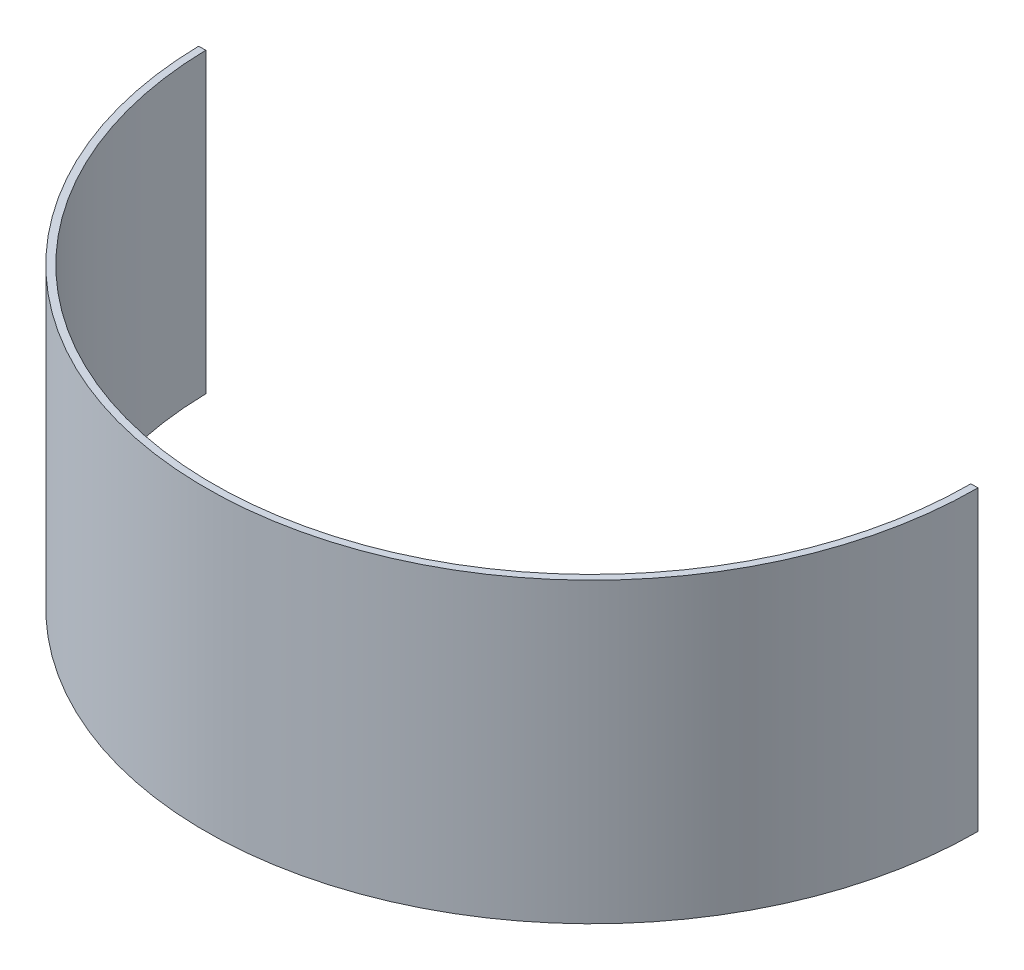
ISO-10303-21;
HEADER;
FILE_DESCRIPTION(('STEP AP214'),'2;1');
FILE_NAME('part.step','',(''),(''),'','','');
FILE_SCHEMA(('AUTOMOTIVE_DESIGN { 1 0 10303 214 1 1 1 1 }'));
ENDSEC;
DATA;
#1=APPLICATION_CONTEXT('core data for automotive mechanical design processes');
#2=APPLICATION_PROTOCOL_DEFINITION('international standard','automotive_design',2000,#1);
#3=PRODUCT_CONTEXT('',#1,'mechanical');
#4=PRODUCT('Part','Part','',(#3));
#5=PRODUCT_RELATED_PRODUCT_CATEGORY('part','',(#4));
#6=PRODUCT_DEFINITION_FORMATION('','',#4);
#7=PRODUCT_DEFINITION_CONTEXT('part definition',#1,'design');
#8=PRODUCT_DEFINITION('design','',#6,#7);
#9=PRODUCT_DEFINITION_SHAPE('','',#8);
#10=(LENGTH_UNIT() NAMED_UNIT(*) SI_UNIT(.MILLI.,.METRE.));
#11=(NAMED_UNIT(*) PLANE_ANGLE_UNIT() SI_UNIT($,.RADIAN.));
#12=(NAMED_UNIT(*) SI_UNIT($,.STERADIAN.) SOLID_ANGLE_UNIT());
#13=UNCERTAINTY_MEASURE_WITH_UNIT(LENGTH_MEASURE(1.E-05),#10,'distance_accuracy_value','');
#14=(GEOMETRIC_REPRESENTATION_CONTEXT(3) GLOBAL_UNCERTAINTY_ASSIGNED_CONTEXT((#13)) GLOBAL_UNIT_ASSIGNED_CONTEXT((#10,
#11,#12)) REPRESENTATION_CONTEXT('',''));
#15=CARTESIAN_POINT('',(0.,0.,0.));
#16=DIRECTION('',(0.,0.,1.));
#17=DIRECTION('',(1.,0.,0.));
#18=AXIS2_PLACEMENT_3D('',#15,#16,#17);
#19=CARTESIAN_POINT('',(0.,66.675,0.));
#20=DIRECTION('',(0.,-1.,0.));
#21=DIRECTION('',(0.,0.,-1.));
#22=AXIS2_PLACEMENT_3D('',#19,#20,#21);
#23=CYLINDRICAL_SURFACE('',#22,169.8625);
#24=CARTESIAN_POINT('',(0.,-66.675,0.));
#25=DIRECTION('',(0.,1.,0.));
#26=DIRECTION('',(0.,0.,1.));
#27=AXIS2_PLACEMENT_3D('',#24,#25,#26);
#28=CIRCLE('',#27,169.8625);
#29=CARTESIAN_POINT('',(-169.832824510605,-66.675,3.17500000000001));
#30=VERTEX_POINT('',#29);
#31=CARTESIAN_POINT('',(169.8625,-66.675,0.));
#32=VERTEX_POINT('',#31);
#33=EDGE_CURVE('E112',#30,#32,#28,.T.);
#34=ORIENTED_EDGE('',*,*,#33,.F.);
#35=DIRECTION('',(0.,-1.,0.));
#36=VECTOR('',#35,1.);
#37=CARTESIAN_POINT('',(-169.832824510605,66.675,3.17500000000001));
#38=LINE('',#37,#36);
#39=CARTESIAN_POINT('',(-169.832824510605,66.675,3.17500000000001));
#40=VERTEX_POINT('',#39);
#41=EDGE_CURVE('E13',#40,#30,#38,.T.);
#42=ORIENTED_EDGE('',*,*,#41,.F.);
#43=CARTESIAN_POINT('',(0.,66.675,0.));
#44=DIRECTION('',(0.,1.,0.));
#45=DIRECTION('',(0.,0.,1.));
#46=AXIS2_PLACEMENT_3D('',#43,#44,#45);
#47=CIRCLE('',#46,169.8625);
#48=CARTESIAN_POINT('',(169.8625,66.675,0.));
#49=VERTEX_POINT('',#48);
#50=EDGE_CURVE('E106',#40,#49,#47,.T.);
#51=ORIENTED_EDGE('',*,*,#50,.T.);
#52=DIRECTION('',(0.,-1.,0.));
#53=VECTOR('',#52,1.);
#54=CARTESIAN_POINT('',(169.8625,66.675,0.));
#55=LINE('',#54,#53);
#56=EDGE_CURVE('E50',#49,#32,#55,.T.);
#57=ORIENTED_EDGE('',*,*,#56,.T.);
#58=EDGE_LOOP('',(#34,#42,#51,#57));
#59=FACE_BOUND('',#58,.T.);
#60=ADVANCED_FACE('F47',(#59),#23,.F.);
#61=CARTESIAN_POINT('',(-169.832824510605,66.675,3.17500000000001));
#62=DIRECTION('',(0.0186915887850469,0.,0.999825296993775));
#63=DIRECTION('',(0.999825296993775,0.,-0.0186915887850469));
#64=AXIS2_PLACEMENT_3D('',#61,#62,#63);
#65=PLANE('',#64);
#66=DIRECTION('',(-0.999825296993775,0.,0.0186915887850469));
#67=VECTOR('',#66,1.);
#68=CARTESIAN_POINT('',(-169.832824510605,-66.675,3.17500000000001));
#69=LINE('',#68,#67);
#70=CARTESIAN_POINT('',(-173.00726982856,-66.675,3.23434579439264));
#71=VERTEX_POINT('',#70);
#72=EDGE_CURVE('E108',#30,#71,#69,.T.);
#73=ORIENTED_EDGE('',*,*,#72,.T.);
#74=DIRECTION('',(0.,-1.,0.));
#75=VECTOR('',#74,1.);
#76=CARTESIAN_POINT('',(-173.00726982856,66.675,3.23434579439264));
#77=LINE('',#76,#75);
#78=CARTESIAN_POINT('',(-173.00726982856,66.675,3.23434579439264));
#79=VERTEX_POINT('',#78);
#80=EDGE_CURVE('E56',#79,#71,#77,.T.);
#81=ORIENTED_EDGE('',*,*,#80,.F.);
#82=DIRECTION('',(-0.999825296993775,0.,0.0186915887850469));
#83=VECTOR('',#82,1.);
#84=CARTESIAN_POINT('',(-169.832824510605,66.675,3.17500000000001));
#85=LINE('',#84,#83);
#86=EDGE_CURVE('E103',#40,#79,#85,.T.);
#87=ORIENTED_EDGE('',*,*,#86,.F.);
#88=ORIENTED_EDGE('',*,*,#41,.T.);
#89=EDGE_LOOP('',(#73,#81,#87,#88));
#90=FACE_BOUND('',#89,.T.);
#91=ADVANCED_FACE('F119',(#90),#65,.F.);
#92=CARTESIAN_POINT('',(0.,66.675,0.));
#93=DIRECTION('',(0.,-1.,0.));
#94=DIRECTION('',(0.,0.,-1.));
#95=AXIS2_PLACEMENT_3D('',#92,#93,#94);
#96=CYLINDRICAL_SURFACE('',#95,173.0375);
#97=CARTESIAN_POINT('',(0.,-66.675,0.));
#98=DIRECTION('',(0.,-1.,0.));
#99=DIRECTION('',(0.,0.,-1.));
#100=AXIS2_PLACEMENT_3D('',#97,#98,#99);
#101=CIRCLE('',#100,173.0375);
#102=CARTESIAN_POINT('',(173.0375,-66.675,0.));
#103=VERTEX_POINT('',#102);
#104=EDGE_CURVE('E97',#103,#71,#101,.T.);
#105=ORIENTED_EDGE('',*,*,#104,.F.);
#106=DIRECTION('',(0.,-1.,0.));
#107=VECTOR('',#106,1.);
#108=CARTESIAN_POINT('',(173.0375,66.675,0.));
#109=LINE('',#108,#107);
#110=CARTESIAN_POINT('',(173.0375,66.675,0.));
#111=VERTEX_POINT('',#110);
#112=EDGE_CURVE('E92',#111,#103,#109,.T.);
#113=ORIENTED_EDGE('',*,*,#112,.F.);
#114=CARTESIAN_POINT('',(0.,66.675,0.));
#115=DIRECTION('',(0.,-1.,0.));
#116=DIRECTION('',(0.,0.,-1.));
#117=AXIS2_PLACEMENT_3D('',#114,#115,#116);
#118=CIRCLE('',#117,173.0375);
#119=EDGE_CURVE('E95',#111,#79,#118,.T.);
#120=ORIENTED_EDGE('',*,*,#119,.T.);
#121=ORIENTED_EDGE('',*,*,#80,.T.);
#122=EDGE_LOOP('',(#105,#113,#120,#121));
#123=FACE_BOUND('',#122,.T.);
#124=ADVANCED_FACE('F94',(#123),#96,.T.);
#125=CARTESIAN_POINT('',(169.8625,66.675,0.));
#126=DIRECTION('',(0.,0.,-1.));
#127=DIRECTION('',(-1.,0.,0.));
#128=AXIS2_PLACEMENT_3D('',#125,#126,#127);
#129=PLANE('',#128);
#130=DIRECTION('',(1.,0.,0.));
#131=VECTOR('',#130,1.);
#132=CARTESIAN_POINT('',(169.8625,-66.675,0.));
#133=LINE('',#132,#131);
#134=EDGE_CURVE('E115',#32,#103,#133,.T.);
#135=ORIENTED_EDGE('',*,*,#134,.F.);
#136=ORIENTED_EDGE('',*,*,#56,.F.);
#137=DIRECTION('',(1.,0.,0.));
#138=VECTOR('',#137,1.);
#139=CARTESIAN_POINT('',(169.8625,66.675,0.));
#140=LINE('',#139,#138);
#141=EDGE_CURVE('E102',#49,#111,#140,.T.);
#142=ORIENTED_EDGE('',*,*,#141,.T.);
#143=ORIENTED_EDGE('',*,*,#112,.T.);
#144=EDGE_LOOP('',(#135,#136,#142,#143));
#145=FACE_BOUND('',#144,.T.);
#146=ADVANCED_FACE('F105',(#145),#129,.T.);
#147=CARTESIAN_POINT('',(0.,66.675,0.));
#148=DIRECTION('',(0.,1.,0.));
#149=DIRECTION('',(0.,0.,1.));
#150=AXIS2_PLACEMENT_3D('',#147,#148,#149);
#151=PLANE('',#150);
#152=ORIENTED_EDGE('',*,*,#50,.F.);
#153=ORIENTED_EDGE('',*,*,#86,.T.);
#154=ORIENTED_EDGE('',*,*,#119,.F.);
#155=ORIENTED_EDGE('',*,*,#141,.F.);
#156=EDGE_LOOP('',(#152,#153,#154,#155));
#157=FACE_BOUND('',#156,.T.);
#158=ADVANCED_FACE('F101',(#157),#151,.T.);
#159=CARTESIAN_POINT('',(0.,-66.675,0.));
#160=DIRECTION('',(0.,1.,0.));
#161=DIRECTION('',(0.,0.,1.));
#162=AXIS2_PLACEMENT_3D('',#159,#160,#161);
#163=PLANE('',#162);
#164=ORIENTED_EDGE('',*,*,#33,.T.);
#165=ORIENTED_EDGE('',*,*,#134,.T.);
#166=ORIENTED_EDGE('',*,*,#104,.T.);
#167=ORIENTED_EDGE('',*,*,#72,.F.);
#168=EDGE_LOOP('',(#164,#165,#166,#167));
#169=FACE_BOUND('',#168,.T.);
#170=ADVANCED_FACE('F121',(#169),#163,.F.);
#171=CLOSED_SHELL('',(#60,#91,#124,#146,#158,#170));
#172=MANIFOLD_SOLID_BREP('B2',#171);
#173=ADVANCED_BREP_SHAPE_REPRESENTATION('',(#18,#172),#14);
#174=SHAPE_DEFINITION_REPRESENTATION(#9,#173);
ENDSEC;
END-ISO-10303-21;
